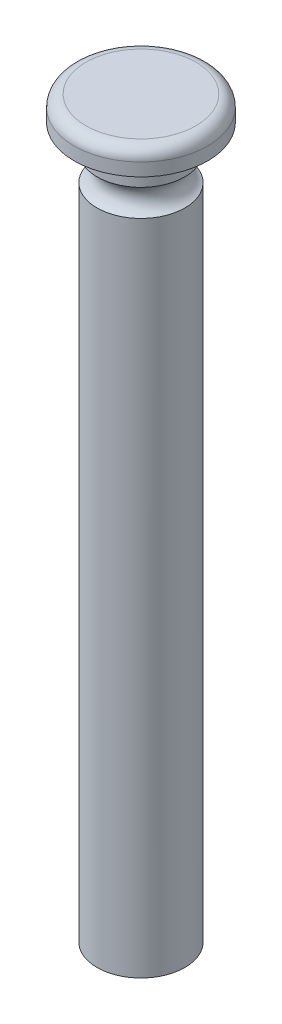
ISO-10303-21;
HEADER;
FILE_DESCRIPTION(('STEP AP214'),'2;1');
FILE_NAME('part.step','',(''),(''),'','','');
FILE_SCHEMA(('AUTOMOTIVE_DESIGN { 1 0 10303 214 1 1 1 1 }'));
ENDSEC;
DATA;
#1=APPLICATION_CONTEXT('core data for automotive mechanical design processes');
#2=APPLICATION_PROTOCOL_DEFINITION('international standard','automotive_design',2000,#1);
#3=PRODUCT_CONTEXT('',#1,'mechanical');
#4=PRODUCT('Part','Part','',(#3));
#5=PRODUCT_RELATED_PRODUCT_CATEGORY('part','',(#4));
#6=PRODUCT_DEFINITION_FORMATION('','',#4);
#7=PRODUCT_DEFINITION_CONTEXT('part definition',#1,'design');
#8=PRODUCT_DEFINITION('design','',#6,#7);
#9=PRODUCT_DEFINITION_SHAPE('','',#8);
#10=(LENGTH_UNIT() NAMED_UNIT(*) SI_UNIT(.MILLI.,.METRE.));
#11=(NAMED_UNIT(*) PLANE_ANGLE_UNIT() SI_UNIT($,.RADIAN.));
#12=(NAMED_UNIT(*) SI_UNIT($,.STERADIAN.) SOLID_ANGLE_UNIT());
#13=UNCERTAINTY_MEASURE_WITH_UNIT(LENGTH_MEASURE(1.E-05),#10,'distance_accuracy_value','');
#14=(GEOMETRIC_REPRESENTATION_CONTEXT(3) GLOBAL_UNCERTAINTY_ASSIGNED_CONTEXT((#13)) GLOBAL_UNIT_ASSIGNED_CONTEXT((#10,
#11,#12)) REPRESENTATION_CONTEXT('',''));
#15=CARTESIAN_POINT('',(0.,0.,0.));
#16=DIRECTION('',(0.,0.,1.));
#17=DIRECTION('',(1.,0.,0.));
#18=AXIS2_PLACEMENT_3D('',#15,#16,#17);
#19=CARTESIAN_POINT('',(0.,153.924,0.));
#20=DIRECTION('',(0.,-1.,0.));
#21=DIRECTION('',(0.,0.,-1.));
#22=AXIS2_PLACEMENT_3D('',#19,#20,#21);
#23=CYLINDRICAL_SURFACE('',#22,9.525);
#24=CARTESIAN_POINT('',(0.,148.463,0.));
#25=DIRECTION('',(0.,-1.,0.));
#26=DIRECTION('',(1.,0.,0.));
#27=AXIS2_PLACEMENT_3D('',#24,#25,#26);
#28=CIRCLE('',#27,9.525);
#29=CARTESIAN_POINT('',(9.525,148.463,0.));
#30=VERTEX_POINT('',#29);
#31=EDGE_CURVE('E53',#30,#30,#28,.T.);
#32=ORIENTED_EDGE('',*,*,#31,.F.);
#33=EDGE_LOOP('',(#32));
#34=FACE_BOUND('',#33,.T.);
#35=CARTESIAN_POINT('',(0.,153.924,0.));
#36=DIRECTION('',(0.,1.,0.));
#37=DIRECTION('',(0.,0.,1.));
#38=AXIS2_PLACEMENT_3D('',#35,#36,#37);
#39=CIRCLE('',#38,9.525);
#40=CARTESIAN_POINT('',(0.,153.924,9.525));
#41=VERTEX_POINT('',#40);
#42=EDGE_CURVE('E41',#41,#41,#39,.T.);
#43=ORIENTED_EDGE('',*,*,#42,.F.);
#44=EDGE_LOOP('',(#43));
#45=FACE_BOUND('',#44,.T.);
#46=ADVANCED_FACE('F30',(#34,#45),#23,.T.);
#47=CARTESIAN_POINT('',(0.,153.924,0.));
#48=DIRECTION('',(0.,1.,0.));
#49=DIRECTION('',(0.,0.,1.));
#50=AXIS2_PLACEMENT_3D('',#47,#48,#49);
#51=PLANE('',#50);
#52=CARTESIAN_POINT('',(0.,153.924,0.));
#53=DIRECTION('',(0.,1.,0.));
#54=DIRECTION('',(0.,0.,1.));
#55=AXIS2_PLACEMENT_3D('',#52,#53,#54);
#56=CIRCLE('',#55,14.478);
#57=CARTESIAN_POINT('',(0.,153.924,14.478));
#58=VERTEX_POINT('',#57);
#59=EDGE_CURVE('E49',#58,#58,#56,.T.);
#60=ORIENTED_EDGE('',*,*,#59,.F.);
#61=EDGE_LOOP('',(#60));
#62=FACE_BOUND('',#61,.T.);
#63=ORIENTED_EDGE('',*,*,#42,.T.);
#64=EDGE_LOOP('',(#63));
#65=FACE_BOUND('',#64,.T.);
#66=ADVANCED_FACE('F73',(#62,#65),#51,.F.);
#67=CARTESIAN_POINT('',(0.,159.258,0.));
#68=DIRECTION('',(0.,-1.,0.));
#69=DIRECTION('',(0.,0.,-1.));
#70=AXIS2_PLACEMENT_3D('',#67,#68,#69);
#71=CYLINDRICAL_SURFACE('',#70,14.478);
#72=CARTESIAN_POINT('',(0.,156.718,0.));
#73=DIRECTION('',(0.,1.,0.));
#74=DIRECTION('',(0.,0.,1.));
#75=AXIS2_PLACEMENT_3D('',#72,#73,#74);
#76=CIRCLE('',#75,14.478);
#77=CARTESIAN_POINT('',(0.,156.718,14.478));
#78=VERTEX_POINT('',#77);
#79=EDGE_CURVE('E10',#78,#78,#76,.F.);
#80=ORIENTED_EDGE('',*,*,#79,.T.);
#81=EDGE_LOOP('',(#80));
#82=FACE_BOUND('',#81,.T.);
#83=ORIENTED_EDGE('',*,*,#59,.T.);
#84=EDGE_LOOP('',(#83));
#85=FACE_BOUND('',#84,.T.);
#86=ADVANCED_FACE('F77',(#82,#85),#71,.T.);
#87=CARTESIAN_POINT('',(0.,159.258,0.));
#88=DIRECTION('',(0.,1.,0.));
#89=DIRECTION('',(0.,0.,1.));
#90=AXIS2_PLACEMENT_3D('',#87,#88,#89);
#91=PLANE('',#90);
#92=CARTESIAN_POINT('',(0.,159.258,0.));
#93=DIRECTION('',(0.,1.,0.));
#94=DIRECTION('',(0.,0.,1.));
#95=AXIS2_PLACEMENT_3D('',#92,#93,#94);
#96=CIRCLE('',#95,11.938);
#97=CARTESIAN_POINT('',(0.,159.258,11.938));
#98=VERTEX_POINT('',#97);
#99=EDGE_CURVE('E37',#98,#98,#96,.T.);
#100=ORIENTED_EDGE('',*,*,#99,.T.);
#101=EDGE_LOOP('',(#100));
#102=FACE_BOUND('',#101,.T.);
#103=ADVANCED_FACE('F67',(#102),#91,.T.);
#104=CARTESIAN_POINT('',(0.,145.542,0.));
#105=DIRECTION('',(0.,-1.,0.));
#106=DIRECTION('',(1.,0.,0.));
#107=AXIS2_PLACEMENT_3D('',#104,#105,#106);
#108=TOROIDAL_SURFACE('',#107,10.7960601249496,3.1855666436659);
#109=CARTESIAN_POINT('',(0.,142.621,0.));
#110=DIRECTION('',(0.,-1.,0.));
#111=DIRECTION('',(1.,0.,0.));
#112=AXIS2_PLACEMENT_3D('',#109,#110,#111);
#113=CIRCLE('',#112,9.525);
#114=CARTESIAN_POINT('',(9.525,142.621,0.));
#115=VERTEX_POINT('',#114);
#116=EDGE_CURVE('E56',#115,#115,#113,.T.);
#117=ORIENTED_EDGE('',*,*,#116,.F.);
#118=EDGE_LOOP('',(#117));
#119=FACE_BOUND('',#118,.T.);
#120=ORIENTED_EDGE('',*,*,#31,.T.);
#121=EDGE_LOOP('',(#120));
#122=FACE_BOUND('',#121,.T.);
#123=ADVANCED_FACE('F63',(#119,#122),#108,.F.);
#124=CARTESIAN_POINT('',(0.,0.,0.));
#125=DIRECTION('',(0.,1.,0.));
#126=DIRECTION('',(0.,0.,1.));
#127=AXIS2_PLACEMENT_3D('',#124,#125,#126);
#128=PLANE('',#127);
#129=CARTESIAN_POINT('',(0.,0.,0.));
#130=DIRECTION('',(0.,1.,0.));
#131=DIRECTION('',(0.,0.,1.));
#132=AXIS2_PLACEMENT_3D('',#129,#130,#131);
#133=CIRCLE('',#132,9.525);
#134=CARTESIAN_POINT('',(0.,0.,9.525));
#135=VERTEX_POINT('',#134);
#136=EDGE_CURVE('E45',#135,#135,#133,.T.);
#137=ORIENTED_EDGE('',*,*,#136,.F.);
#138=EDGE_LOOP('',(#137));
#139=FACE_BOUND('',#138,.T.);
#140=ADVANCED_FACE('F66',(#139),#128,.F.);
#141=ORIENTED_EDGE('',*,*,#116,.T.);
#142=EDGE_LOOP('',(#141));
#143=FACE_BOUND('',#142,.T.);
#144=ORIENTED_EDGE('',*,*,#136,.T.);
#145=EDGE_LOOP('',(#144));
#146=FACE_BOUND('',#145,.T.);
#147=ADVANCED_FACE('F60',(#143,#146),#23,.T.);
#148=CARTESIAN_POINT('',(0.,156.718,0.));
#149=DIRECTION('',(0.,1.,0.));
#150=DIRECTION('',(0.,0.,1.));
#151=AXIS2_PLACEMENT_3D('',#148,#149,#150);
#152=TOROIDAL_SURFACE('',#151,11.938,2.54);
#153=ORIENTED_EDGE('',*,*,#79,.F.);
#154=EDGE_LOOP('',(#153));
#155=FACE_BOUND('',#154,.T.);
#156=ORIENTED_EDGE('',*,*,#99,.F.);
#157=EDGE_LOOP('',(#156));
#158=FACE_BOUND('',#157,.T.);
#159=ADVANCED_FACE('F32',(#155,#158),#152,.T.);
#160=CLOSED_SHELL('',(#46,#66,#86,#103,#123,#140,#147,#159));
#161=MANIFOLD_SOLID_BREP('B2',#160);
#162=ADVANCED_BREP_SHAPE_REPRESENTATION('',(#18,#161),#14);
#163=SHAPE_DEFINITION_REPRESENTATION(#9,#162);
ENDSEC;
END-ISO-10303-21;
